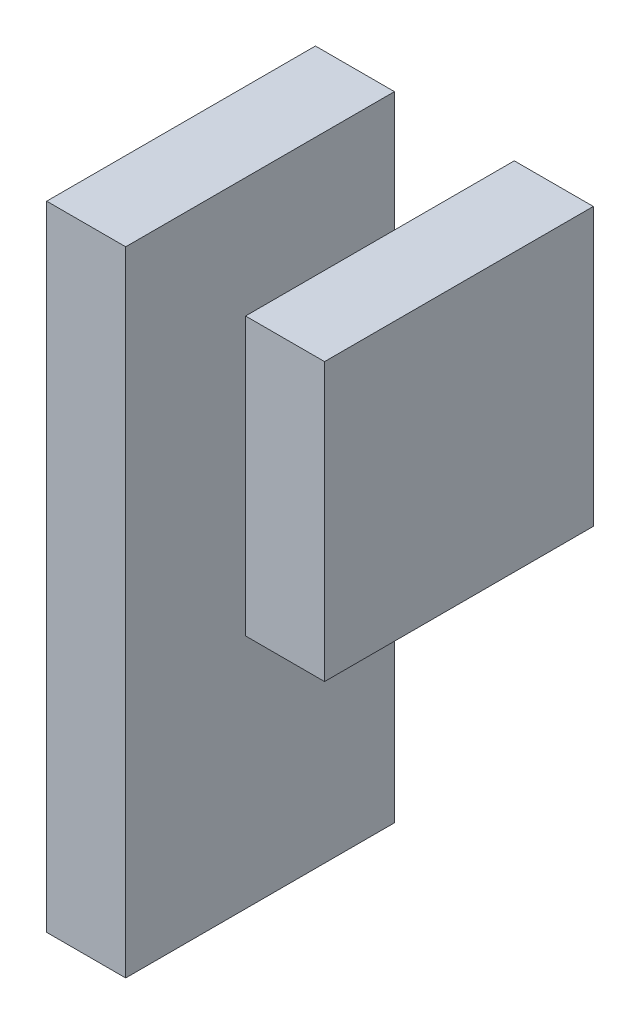
ISO-10303-21;
HEADER;
FILE_DESCRIPTION(('STEP AP214'),'2;1');
FILE_NAME('part.step','',(''),(''),'','','');
FILE_SCHEMA(('AUTOMOTIVE_DESIGN { 1 0 10303 214 1 1 1 1 }'));
ENDSEC;
DATA;
#1=APPLICATION_CONTEXT('core data for automotive mechanical design processes');
#2=APPLICATION_PROTOCOL_DEFINITION('international standard','automotive_design',2000,#1);
#3=PRODUCT_CONTEXT('',#1,'mechanical');
#4=PRODUCT('Part','Part','',(#3));
#5=PRODUCT_RELATED_PRODUCT_CATEGORY('part','',(#4));
#6=PRODUCT_DEFINITION_FORMATION('','',#4);
#7=PRODUCT_DEFINITION_CONTEXT('part definition',#1,'design');
#8=PRODUCT_DEFINITION('design','',#6,#7);
#9=PRODUCT_DEFINITION_SHAPE('','',#8);
#10=(LENGTH_UNIT() NAMED_UNIT(*) SI_UNIT(.MILLI.,.METRE.));
#11=(NAMED_UNIT(*) PLANE_ANGLE_UNIT() SI_UNIT($,.RADIAN.));
#12=(NAMED_UNIT(*) SI_UNIT($,.STERADIAN.) SOLID_ANGLE_UNIT());
#13=UNCERTAINTY_MEASURE_WITH_UNIT(LENGTH_MEASURE(1.E-05),#10,'distance_accuracy_value','');
#14=(GEOMETRIC_REPRESENTATION_CONTEXT(3) GLOBAL_UNCERTAINTY_ASSIGNED_CONTEXT((#13)) GLOBAL_UNIT_ASSIGNED_CONTEXT((#10,
#11,#12)) REPRESENTATION_CONTEXT('',''));
#15=CARTESIAN_POINT('',(0.,0.,0.));
#16=DIRECTION('',(0.,0.,1.));
#17=DIRECTION('',(1.,0.,0.));
#18=AXIS2_PLACEMENT_3D('',#15,#16,#17);
#19=CARTESIAN_POINT('',(158.1725,-64.7525,10.));
#20=DIRECTION('',(-1.,0.,0.));
#21=DIRECTION('',(0.,0.,1.));
#22=AXIS2_PLACEMENT_3D('',#19,#20,#21);
#23=PLANE('',#22);
#24=DIRECTION('',(0.,1.,0.));
#25=VECTOR('',#24,1.);
#26=CARTESIAN_POINT('',(158.1725,-64.7525,0.));
#27=LINE('',#26,#25);
#28=CARTESIAN_POINT('',(158.1725,-64.7525,0.));
#29=VERTEX_POINT('',#28);
#30=CARTESIAN_POINT('',(158.1725,-54.4425,0.));
#31=VERTEX_POINT('',#30);
#32=EDGE_CURVE('E12',#29,#31,#27,.T.);
#33=ORIENTED_EDGE('',*,*,#32,.T.);
#34=DIRECTION('',(0.,0.,-1.));
#35=VECTOR('',#34,1.);
#36=CARTESIAN_POINT('',(158.1725,-54.4425,10.));
#37=LINE('',#36,#35);
#38=CARTESIAN_POINT('',(158.1725,-54.4425,10.));
#39=VERTEX_POINT('',#38);
#40=EDGE_CURVE('E118',#39,#31,#37,.T.);
#41=ORIENTED_EDGE('',*,*,#40,.F.);
#42=DIRECTION('',(0.,1.,0.));
#43=VECTOR('',#42,1.);
#44=CARTESIAN_POINT('',(158.1725,-64.7525,10.));
#45=LINE('',#44,#43);
#46=CARTESIAN_POINT('',(158.1725,-64.7525,10.));
#47=VERTEX_POINT('',#46);
#48=EDGE_CURVE('E51',#47,#39,#45,.T.);
#49=ORIENTED_EDGE('',*,*,#48,.F.);
#50=DIRECTION('',(0.,0.,-1.));
#51=VECTOR('',#50,1.);
#52=CARTESIAN_POINT('',(158.1725,-64.7525,10.));
#53=LINE('',#52,#51);
#54=EDGE_CURVE('E106',#47,#29,#53,.T.);
#55=ORIENTED_EDGE('',*,*,#54,.T.);
#56=EDGE_LOOP('',(#33,#41,#49,#55));
#57=FACE_BOUND('',#56,.T.);
#58=ADVANCED_FACE('F47',(#57),#23,.F.);
#59=CARTESIAN_POINT('',(158.1725,-54.4425,10.));
#60=DIRECTION('',(0.,-1.,0.));
#61=DIRECTION('',(0.,0.,-1.));
#62=AXIS2_PLACEMENT_3D('',#59,#60,#61);
#63=PLANE('',#62);
#64=DIRECTION('',(-1.,0.,0.));
#65=VECTOR('',#64,1.);
#66=CARTESIAN_POINT('',(158.1725,-54.4425,0.));
#67=LINE('',#66,#65);
#68=CARTESIAN_POINT('',(155.2325,-54.4425,0.));
#69=VERTEX_POINT('',#68);
#70=EDGE_CURVE('E57',#31,#69,#67,.T.);
#71=ORIENTED_EDGE('',*,*,#70,.T.);
#72=DIRECTION('',(0.,0.,-1.));
#73=VECTOR('',#72,1.);
#74=CARTESIAN_POINT('',(155.2325,-54.4425,10.));
#75=LINE('',#74,#73);
#76=CARTESIAN_POINT('',(155.2325,-54.4425,10.));
#77=VERTEX_POINT('',#76);
#78=EDGE_CURVE('E102',#77,#69,#75,.T.);
#79=ORIENTED_EDGE('',*,*,#78,.F.);
#80=DIRECTION('',(-1.,0.,0.));
#81=VECTOR('',#80,1.);
#82=CARTESIAN_POINT('',(158.1725,-54.4425,10.));
#83=LINE('',#82,#81);
#84=EDGE_CURVE('E81',#39,#77,#83,.T.);
#85=ORIENTED_EDGE('',*,*,#84,.F.);
#86=ORIENTED_EDGE('',*,*,#40,.T.);
#87=EDGE_LOOP('',(#71,#79,#85,#86));
#88=FACE_BOUND('',#87,.T.);
#89=ADVANCED_FACE('F121',(#88),#63,.F.);
#90=CARTESIAN_POINT('',(155.2325,-64.7525,10.));
#91=DIRECTION('',(1.,0.,0.));
#92=DIRECTION('',(0.,0.,-1.));
#93=AXIS2_PLACEMENT_3D('',#90,#91,#92);
#94=PLANE('',#93);
#95=DIRECTION('',(0.,-1.,0.));
#96=VECTOR('',#95,1.);
#97=CARTESIAN_POINT('',(155.2325,-64.7525,0.));
#98=LINE('',#97,#96);
#99=CARTESIAN_POINT('',(155.2325,-64.7525,0.));
#100=VERTEX_POINT('',#99);
#101=EDGE_CURVE('E97',#69,#100,#98,.T.);
#102=ORIENTED_EDGE('',*,*,#101,.T.);
#103=DIRECTION('',(0.,0.,-1.));
#104=VECTOR('',#103,1.);
#105=CARTESIAN_POINT('',(155.2325,-64.7525,10.));
#106=LINE('',#105,#104);
#107=CARTESIAN_POINT('',(155.2325,-64.7525,10.));
#108=VERTEX_POINT('',#107);
#109=EDGE_CURVE('E100',#108,#100,#106,.T.);
#110=ORIENTED_EDGE('',*,*,#109,.F.);
#111=DIRECTION('',(0.,-1.,0.));
#112=VECTOR('',#111,1.);
#113=CARTESIAN_POINT('',(155.2325,-64.7525,10.));
#114=LINE('',#113,#112);
#115=EDGE_CURVE('E114',#77,#108,#114,.T.);
#116=ORIENTED_EDGE('',*,*,#115,.F.);
#117=ORIENTED_EDGE('',*,*,#78,.T.);
#118=EDGE_LOOP('',(#102,#110,#116,#117));
#119=FACE_BOUND('',#118,.T.);
#120=ADVANCED_FACE('F98',(#119),#94,.F.);
#121=CARTESIAN_POINT('',(158.1725,-64.7525,10.));
#122=DIRECTION('',(0.,1.,0.));
#123=DIRECTION('',(0.,0.,1.));
#124=AXIS2_PLACEMENT_3D('',#121,#122,#123);
#125=PLANE('',#124);
#126=DIRECTION('',(1.,0.,0.));
#127=VECTOR('',#126,1.);
#128=CARTESIAN_POINT('',(158.1725,-64.7525,0.));
#129=LINE('',#128,#127);
#130=EDGE_CURVE('E91',#100,#29,#129,.T.);
#131=ORIENTED_EDGE('',*,*,#130,.T.);
#132=ORIENTED_EDGE('',*,*,#54,.F.);
#133=DIRECTION('',(1.,0.,0.));
#134=VECTOR('',#133,1.);
#135=CARTESIAN_POINT('',(158.1725,-64.7525,10.));
#136=LINE('',#135,#134);
#137=EDGE_CURVE('E105',#108,#47,#136,.T.);
#138=ORIENTED_EDGE('',*,*,#137,.F.);
#139=ORIENTED_EDGE('',*,*,#109,.T.);
#140=EDGE_LOOP('',(#131,#132,#138,#139));
#141=FACE_BOUND('',#140,.T.);
#142=ADVANCED_FACE('F104',(#141),#125,.F.);
#143=CARTESIAN_POINT('',(0.,0.,10.));
#144=DIRECTION('',(0.,0.,1.));
#145=DIRECTION('',(1.,0.,0.));
#146=AXIS2_PLACEMENT_3D('',#143,#144,#145);
#147=PLANE('',#146);
#148=ORIENTED_EDGE('',*,*,#48,.T.);
#149=ORIENTED_EDGE('',*,*,#84,.T.);
#150=ORIENTED_EDGE('',*,*,#115,.T.);
#151=ORIENTED_EDGE('',*,*,#137,.T.);
#152=EDGE_LOOP('',(#148,#149,#150,#151));
#153=FACE_BOUND('',#152,.T.);
#154=ADVANCED_FACE('F49',(#153),#147,.T.);
#155=CARTESIAN_POINT('',(0.,0.,0.));
#156=DIRECTION('',(0.,0.,1.));
#157=DIRECTION('',(1.,0.,0.));
#158=AXIS2_PLACEMENT_3D('',#155,#156,#157);
#159=PLANE('',#158);
#160=ORIENTED_EDGE('',*,*,#32,.F.);
#161=ORIENTED_EDGE('',*,*,#130,.F.);
#162=ORIENTED_EDGE('',*,*,#101,.F.);
#163=ORIENTED_EDGE('',*,*,#70,.F.);
#164=EDGE_LOOP('',(#160,#161,#162,#163));
#165=FACE_BOUND('',#164,.T.);
#166=ADVANCED_FACE('F108',(#165),#159,.F.);
#167=CLOSED_SHELL('',(#58,#89,#120,#142,#154,#166));
#168=MANIFOLD_SOLID_BREP('B2',#167);
#169=CARTESIAN_POINT('',(147.8325,-54.4425,10.));
#170=DIRECTION('',(1.,0.,0.));
#171=DIRECTION('',(0.,0.,-1.));
#172=AXIS2_PLACEMENT_3D('',#169,#170,#171);
#173=PLANE('',#172);
#174=DIRECTION('',(0.,-1.,0.));
#175=VECTOR('',#174,1.);
#176=CARTESIAN_POINT('',(147.8325,-54.4425,0.));
#177=LINE('',#176,#175);
#178=CARTESIAN_POINT('',(147.8325,-54.4425,0.));
#179=VERTEX_POINT('',#178);
#180=CARTESIAN_POINT('',(147.8325,-78.005,0.));
#181=VERTEX_POINT('',#180);
#182=EDGE_CURVE('E246',#179,#181,#177,.T.);
#183=ORIENTED_EDGE('',*,*,#182,.T.);
#184=DIRECTION('',(0.,0.,-1.));
#185=VECTOR('',#184,1.);
#186=CARTESIAN_POINT('',(147.8325,-78.005,10.));
#187=LINE('',#186,#185);
#188=CARTESIAN_POINT('',(147.8325,-78.005,10.));
#189=VERTEX_POINT('',#188);
#190=EDGE_CURVE('E45',#189,#181,#187,.T.);
#191=ORIENTED_EDGE('',*,*,#190,.F.);
#192=DIRECTION('',(0.,-1.,0.));
#193=VECTOR('',#192,1.);
#194=CARTESIAN_POINT('',(147.8325,-54.4425,10.));
#195=LINE('',#194,#193);
#196=CARTESIAN_POINT('',(147.8325,-54.4425,10.));
#197=VERTEX_POINT('',#196);
#198=EDGE_CURVE('E234',#197,#189,#195,.T.);
#199=ORIENTED_EDGE('',*,*,#198,.F.);
#200=DIRECTION('',(0.,0.,-1.));
#201=VECTOR('',#200,1.);
#202=CARTESIAN_POINT('',(147.8325,-54.4425,10.));
#203=LINE('',#202,#201);
#204=EDGE_CURVE('E242',#197,#179,#203,.T.);
#205=ORIENTED_EDGE('',*,*,#204,.T.);
#206=EDGE_LOOP('',(#183,#191,#199,#205));
#207=FACE_BOUND('',#206,.T.);
#208=ADVANCED_FACE('F183',(#207),#173,.F.);
#209=CARTESIAN_POINT('',(147.8325,-78.005,10.));
#210=DIRECTION('',(0.,1.,0.));
#211=DIRECTION('',(0.,0.,1.));
#212=AXIS2_PLACEMENT_3D('',#209,#210,#211);
#213=PLANE('',#212);
#214=DIRECTION('',(1.,0.,0.));
#215=VECTOR('',#214,1.);
#216=CARTESIAN_POINT('',(147.8325,-78.005,0.));
#217=LINE('',#216,#215);
#218=CARTESIAN_POINT('',(150.7725,-78.005,0.));
#219=VERTEX_POINT('',#218);
#220=EDGE_CURVE('E238',#181,#219,#217,.T.);
#221=ORIENTED_EDGE('',*,*,#220,.T.);
#222=DIRECTION('',(0.,0.,-1.));
#223=VECTOR('',#222,1.);
#224=CARTESIAN_POINT('',(150.7725,-78.005,10.));
#225=LINE('',#224,#223);
#226=CARTESIAN_POINT('',(150.7725,-78.005,10.));
#227=VERTEX_POINT('',#226);
#228=EDGE_CURVE('E191',#227,#219,#225,.T.);
#229=ORIENTED_EDGE('',*,*,#228,.F.);
#230=DIRECTION('',(1.,0.,0.));
#231=VECTOR('',#230,1.);
#232=CARTESIAN_POINT('',(147.8325,-78.005,10.));
#233=LINE('',#232,#231);
#234=EDGE_CURVE('E229',#189,#227,#233,.T.);
#235=ORIENTED_EDGE('',*,*,#234,.F.);
#236=ORIENTED_EDGE('',*,*,#190,.T.);
#237=EDGE_LOOP('',(#221,#229,#235,#236));
#238=FACE_BOUND('',#237,.T.);
#239=ADVANCED_FACE('F237',(#238),#213,.F.);
#240=CARTESIAN_POINT('',(150.7725,-54.4425,10.));
#241=DIRECTION('',(-1.,0.,0.));
#242=DIRECTION('',(0.,0.,1.));
#243=AXIS2_PLACEMENT_3D('',#240,#241,#242);
#244=PLANE('',#243);
#245=DIRECTION('',(0.,1.,0.));
#246=VECTOR('',#245,1.);
#247=CARTESIAN_POINT('',(150.7725,-54.4425,0.));
#248=LINE('',#247,#246);
#249=CARTESIAN_POINT('',(150.7725,-54.4425,0.));
#250=VERTEX_POINT('',#249);
#251=EDGE_CURVE('E216',#219,#250,#248,.T.);
#252=ORIENTED_EDGE('',*,*,#251,.T.);
#253=DIRECTION('',(0.,0.,-1.));
#254=VECTOR('',#253,1.);
#255=CARTESIAN_POINT('',(150.7725,-54.4425,10.));
#256=LINE('',#255,#254);
#257=CARTESIAN_POINT('',(150.7725,-54.4425,10.));
#258=VERTEX_POINT('',#257);
#259=EDGE_CURVE('E239',#258,#250,#256,.T.);
#260=ORIENTED_EDGE('',*,*,#259,.F.);
#261=DIRECTION('',(0.,1.,0.));
#262=VECTOR('',#261,1.);
#263=CARTESIAN_POINT('',(150.7725,-54.4425,10.));
#264=LINE('',#263,#262);
#265=EDGE_CURVE('E232',#227,#258,#264,.T.);
#266=ORIENTED_EDGE('',*,*,#265,.F.);
#267=ORIENTED_EDGE('',*,*,#228,.T.);
#268=EDGE_LOOP('',(#252,#260,#266,#267));
#269=FACE_BOUND('',#268,.T.);
#270=ADVANCED_FACE('F240',(#269),#244,.F.);
#271=CARTESIAN_POINT('',(147.8325,-54.4425,10.));
#272=DIRECTION('',(0.,-1.,0.));
#273=DIRECTION('',(0.,0.,-1.));
#274=AXIS2_PLACEMENT_3D('',#271,#272,#273);
#275=PLANE('',#274);
#276=DIRECTION('',(-1.,0.,0.));
#277=VECTOR('',#276,1.);
#278=CARTESIAN_POINT('',(147.8325,-54.4425,0.));
#279=LINE('',#278,#277);
#280=EDGE_CURVE('E222',#250,#179,#279,.T.);
#281=ORIENTED_EDGE('',*,*,#280,.T.);
#282=ORIENTED_EDGE('',*,*,#204,.F.);
#283=DIRECTION('',(-1.,0.,0.));
#284=VECTOR('',#283,1.);
#285=CARTESIAN_POINT('',(147.8325,-54.4425,10.));
#286=LINE('',#285,#284);
#287=EDGE_CURVE('E199',#258,#197,#286,.T.);
#288=ORIENTED_EDGE('',*,*,#287,.F.);
#289=ORIENTED_EDGE('',*,*,#259,.T.);
#290=EDGE_LOOP('',(#281,#282,#288,#289));
#291=FACE_BOUND('',#290,.T.);
#292=ADVANCED_FACE('F253',(#291),#275,.F.);
#293=CARTESIAN_POINT('',(0.,0.,10.));
#294=DIRECTION('',(0.,0.,1.));
#295=DIRECTION('',(1.,0.,0.));
#296=AXIS2_PLACEMENT_3D('',#293,#294,#295);
#297=PLANE('',#296);
#298=ORIENTED_EDGE('',*,*,#198,.T.);
#299=ORIENTED_EDGE('',*,*,#234,.T.);
#300=ORIENTED_EDGE('',*,*,#265,.T.);
#301=ORIENTED_EDGE('',*,*,#287,.T.);
#302=EDGE_LOOP('',(#298,#299,#300,#301));
#303=FACE_BOUND('',#302,.T.);
#304=ADVANCED_FACE('F230',(#303),#297,.T.);
#305=CARTESIAN_POINT('',(0.,0.,0.));
#306=DIRECTION('',(0.,0.,1.));
#307=DIRECTION('',(1.,0.,0.));
#308=AXIS2_PLACEMENT_3D('',#305,#306,#307);
#309=PLANE('',#308);
#310=ORIENTED_EDGE('',*,*,#182,.F.);
#311=ORIENTED_EDGE('',*,*,#280,.F.);
#312=ORIENTED_EDGE('',*,*,#251,.F.);
#313=ORIENTED_EDGE('',*,*,#220,.F.);
#314=EDGE_LOOP('',(#310,#311,#312,#313));
#315=FACE_BOUND('',#314,.T.);
#316=ADVANCED_FACE('F256',(#315),#309,.F.);
#317=CLOSED_SHELL('',(#208,#239,#270,#292,#304,#316));
#318=MANIFOLD_SOLID_BREP('B6',#317);
#319=ADVANCED_BREP_SHAPE_REPRESENTATION('',(#18,#168,#318),#14);
#320=SHAPE_DEFINITION_REPRESENTATION(#9,#319);
ENDSEC;
END-ISO-10303-21;
